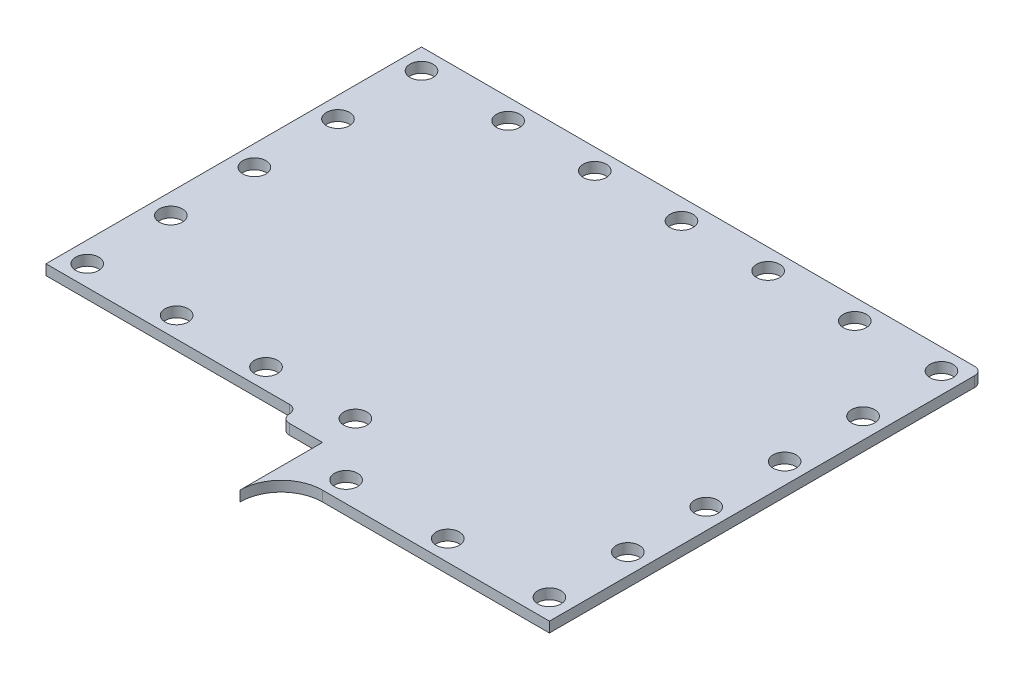
ISO-10303-21;
HEADER;
FILE_DESCRIPTION(('STEP AP214'),'2;1');
FILE_NAME('part.step','',(''),(''),'','','');
FILE_SCHEMA(('AUTOMOTIVE_DESIGN { 1 0 10303 214 1 1 1 1 }'));
ENDSEC;
DATA;
#1=APPLICATION_CONTEXT('core data for automotive mechanical design processes');
#2=APPLICATION_PROTOCOL_DEFINITION('international standard','automotive_design',2000,#1);
#3=PRODUCT_CONTEXT('',#1,'mechanical');
#4=PRODUCT('Part','Part','',(#3));
#5=PRODUCT_RELATED_PRODUCT_CATEGORY('part','',(#4));
#6=PRODUCT_DEFINITION_FORMATION('','',#4);
#7=PRODUCT_DEFINITION_CONTEXT('part definition',#1,'design');
#8=PRODUCT_DEFINITION('design','',#6,#7);
#9=PRODUCT_DEFINITION_SHAPE('','',#8);
#10=(LENGTH_UNIT() NAMED_UNIT(*) SI_UNIT(.MILLI.,.METRE.));
#11=(NAMED_UNIT(*) PLANE_ANGLE_UNIT() SI_UNIT($,.RADIAN.));
#12=(NAMED_UNIT(*) SI_UNIT($,.STERADIAN.) SOLID_ANGLE_UNIT());
#13=UNCERTAINTY_MEASURE_WITH_UNIT(LENGTH_MEASURE(1.E-05),#10,'distance_accuracy_value','');
#14=(GEOMETRIC_REPRESENTATION_CONTEXT(3) GLOBAL_UNCERTAINTY_ASSIGNED_CONTEXT((#13)) GLOBAL_UNIT_ASSIGNED_CONTEXT((#10,
#11,#12)) REPRESENTATION_CONTEXT('',''));
#15=CARTESIAN_POINT('',(0.,0.,0.));
#16=DIRECTION('',(0.,0.,1.));
#17=DIRECTION('',(1.,0.,0.));
#18=AXIS2_PLACEMENT_3D('',#15,#16,#17);
#19=CARTESIAN_POINT('',(8.88999999999993,1.5875,73.025));
#20=DIRECTION('',(0.,-1.,0.));
#21=DIRECTION('',(0.,0.,-1.));
#22=AXIS2_PLACEMENT_3D('',#19,#20,#21);
#23=CYLINDRICAL_SURFACE('',#22,6.34999999999999);
#24=CARTESIAN_POINT('',(8.88999999999993,0.,73.025));
#25=DIRECTION('',(0.,-1.,0.));
#26=DIRECTION('',(0.,0.,1.));
#27=AXIS2_PLACEMENT_3D('',#24,#25,#26);
#28=CIRCLE('',#27,6.34999999999999);
#29=CARTESIAN_POINT('',(2.53999999999993,0.,73.025));
#30=VERTEX_POINT('',#29);
#31=CARTESIAN_POINT('',(8.8899999999999,0.,66.675));
#32=VERTEX_POINT('',#31);
#33=EDGE_CURVE('E154',#30,#32,#28,.T.);
#34=ORIENTED_EDGE('',*,*,#33,.T.);
#35=DIRECTION('',(0.,-1.,0.));
#36=VECTOR('',#35,1.);
#37=CARTESIAN_POINT('',(8.8899999999999,1.5875,66.675));
#38=LINE('',#37,#36);
#39=CARTESIAN_POINT('',(8.8899999999999,1.5875,66.675));
#40=VERTEX_POINT('',#39);
#41=EDGE_CURVE('E11',#40,#32,#38,.T.);
#42=ORIENTED_EDGE('',*,*,#41,.F.);
#43=CARTESIAN_POINT('',(8.88999999999993,1.5875,73.025));
#44=DIRECTION('',(0.,-1.,0.));
#45=DIRECTION('',(0.,0.,1.));
#46=AXIS2_PLACEMENT_3D('',#43,#44,#45);
#47=CIRCLE('',#46,6.34999999999999);
#48=CARTESIAN_POINT('',(2.53999999999993,1.5875,73.025));
#49=VERTEX_POINT('',#48);
#50=EDGE_CURVE('E175',#49,#40,#47,.T.);
#51=ORIENTED_EDGE('',*,*,#50,.F.);
#52=DIRECTION('',(0.,-1.,0.));
#53=VECTOR('',#52,1.);
#54=CARTESIAN_POINT('',(2.53999999999993,1.5875,73.025));
#55=LINE('',#54,#53);
#56=EDGE_CURVE('E150',#49,#30,#55,.T.);
#57=ORIENTED_EDGE('',*,*,#56,.T.);
#58=EDGE_LOOP('',(#34,#42,#51,#57));
#59=FACE_BOUND('',#58,.T.);
#60=ADVANCED_FACE('F40',(#59),#23,.F.);
#61=CARTESIAN_POINT('',(8.8899999999999,1.5875,66.675));
#62=DIRECTION('',(0.,0.,-1.));
#63=DIRECTION('',(-1.,0.,0.));
#64=AXIS2_PLACEMENT_3D('',#61,#62,#63);
#65=PLANE('',#64);
#66=DIRECTION('',(1.,0.,0.));
#67=VECTOR('',#66,1.);
#68=CARTESIAN_POINT('',(8.8899999999999,0.,66.675));
#69=LINE('',#68,#67);
#70=CARTESIAN_POINT('',(43.815,0.,66.675));
#71=VERTEX_POINT('',#70);
#72=EDGE_CURVE('E157',#32,#71,#69,.T.);
#73=ORIENTED_EDGE('',*,*,#72,.T.);
#74=DIRECTION('',(0.,-1.,0.));
#75=VECTOR('',#74,1.);
#76=CARTESIAN_POINT('',(43.815,1.5875,66.675));
#77=LINE('',#76,#75);
#78=CARTESIAN_POINT('',(43.815,1.5875,66.675));
#79=VERTEX_POINT('',#78);
#80=EDGE_CURVE('E48',#79,#71,#77,.T.);
#81=ORIENTED_EDGE('',*,*,#80,.F.);
#82=DIRECTION('',(1.,0.,0.));
#83=VECTOR('',#82,1.);
#84=CARTESIAN_POINT('',(8.8899999999999,1.5875,66.675));
#85=LINE('',#84,#83);
#86=EDGE_CURVE('E108',#40,#79,#85,.T.);
#87=ORIENTED_EDGE('',*,*,#86,.F.);
#88=ORIENTED_EDGE('',*,*,#41,.T.);
#89=EDGE_LOOP('',(#73,#81,#87,#88));
#90=FACE_BOUND('',#89,.T.);
#91=ADVANCED_FACE('F248',(#90),#65,.F.);
#92=CARTESIAN_POINT('',(43.815,1.5875,66.675));
#93=DIRECTION('',(-1.,0.,0.));
#94=DIRECTION('',(0.,0.,1.));
#95=AXIS2_PLACEMENT_3D('',#92,#93,#94);
#96=PLANE('',#95);
#97=DIRECTION('',(0.,0.,-1.));
#98=VECTOR('',#97,1.);
#99=CARTESIAN_POINT('',(43.815,0.,66.675));
#100=LINE('',#99,#98);
#101=CARTESIAN_POINT('',(43.815,0.,1.26999999999999));
#102=VERTEX_POINT('',#101);
#103=EDGE_CURVE('E160',#71,#102,#100,.T.);
#104=ORIENTED_EDGE('',*,*,#103,.T.);
#105=DIRECTION('',(0.,-1.,0.));
#106=VECTOR('',#105,1.);
#107=CARTESIAN_POINT('',(43.815,1.5875,1.26999999999999));
#108=LINE('',#107,#106);
#109=CARTESIAN_POINT('',(43.815,1.5875,1.26999999999999));
#110=VERTEX_POINT('',#109);
#111=EDGE_CURVE('E191',#110,#102,#108,.T.);
#112=ORIENTED_EDGE('',*,*,#111,.F.);
#113=DIRECTION('',(0.,0.,-1.));
#114=VECTOR('',#113,1.);
#115=CARTESIAN_POINT('',(43.815,1.5875,66.675));
#116=LINE('',#115,#114);
#117=EDGE_CURVE('E199',#79,#110,#116,.T.);
#118=ORIENTED_EDGE('',*,*,#117,.F.);
#119=ORIENTED_EDGE('',*,*,#80,.T.);
#120=EDGE_LOOP('',(#104,#112,#118,#119));
#121=FACE_BOUND('',#120,.T.);
#122=ADVANCED_FACE('F197',(#121),#96,.F.);
#123=CARTESIAN_POINT('',(42.5796667647193,1.5875,1.23533323528069));
#124=DIRECTION('',(0.,-1.,0.));
#125=DIRECTION('',(0.,0.,-1.));
#126=AXIS2_PLACEMENT_3D('',#123,#124,#125);
#127=CYLINDRICAL_SURFACE('',#126,1.23581956076328);
#128=CARTESIAN_POINT('',(42.5796667647193,0.,1.23533323528069));
#129=DIRECTION('',(0.,1.,0.));
#130=DIRECTION('',(0.,0.,1.));
#131=AXIS2_PLACEMENT_3D('',#128,#129,#130);
#132=CIRCLE('',#131,1.23581956076328);
#133=CARTESIAN_POINT('',(42.545,0.,0.));
#134=VERTEX_POINT('',#133);
#135=EDGE_CURVE('E162',#102,#134,#132,.T.);
#136=ORIENTED_EDGE('',*,*,#135,.T.);
#137=DIRECTION('',(0.,-1.,0.));
#138=VECTOR('',#137,1.);
#139=CARTESIAN_POINT('',(42.545,1.5875,0.));
#140=LINE('',#139,#138);
#141=CARTESIAN_POINT('',(42.545,1.5875,0.));
#142=VERTEX_POINT('',#141);
#143=EDGE_CURVE('E188',#142,#134,#140,.T.);
#144=ORIENTED_EDGE('',*,*,#143,.F.);
#145=CARTESIAN_POINT('',(42.5796667647193,1.5875,1.23533323528069));
#146=DIRECTION('',(0.,1.,0.));
#147=DIRECTION('',(0.,0.,1.));
#148=AXIS2_PLACEMENT_3D('',#145,#146,#147);
#149=CIRCLE('',#148,1.23581956076328);
#150=EDGE_CURVE('E217',#110,#142,#149,.T.);
#151=ORIENTED_EDGE('',*,*,#150,.F.);
#152=ORIENTED_EDGE('',*,*,#111,.T.);
#153=EDGE_LOOP('',(#136,#144,#151,#152));
#154=FACE_BOUND('',#153,.T.);
#155=ADVANCED_FACE('F208',(#154),#127,.T.);
#156=CARTESIAN_POINT('',(42.545,1.5875,0.));
#157=DIRECTION('',(0.,0.,1.));
#158=DIRECTION('',(1.,0.,0.));
#159=AXIS2_PLACEMENT_3D('',#156,#157,#158);
#160=PLANE('',#159);
#161=DIRECTION('',(-1.,0.,0.));
#162=VECTOR('',#161,1.);
#163=CARTESIAN_POINT('',(42.545,0.,0.));
#164=LINE('',#163,#162);
#165=CARTESIAN_POINT('',(-42.545,0.,0.));
#166=VERTEX_POINT('',#165);
#167=EDGE_CURVE('E164',#134,#166,#164,.T.);
#168=ORIENTED_EDGE('',*,*,#167,.T.);
#169=DIRECTION('',(0.,-1.,0.));
#170=VECTOR('',#169,1.);
#171=CARTESIAN_POINT('',(-42.545,1.5875,0.));
#172=LINE('',#171,#170);
#173=CARTESIAN_POINT('',(-42.545,1.5875,0.));
#174=VERTEX_POINT('',#173);
#175=EDGE_CURVE('E185',#174,#166,#172,.T.);
#176=ORIENTED_EDGE('',*,*,#175,.F.);
#177=DIRECTION('',(-1.,0.,0.));
#178=VECTOR('',#177,1.);
#179=CARTESIAN_POINT('',(42.545,1.5875,0.));
#180=LINE('',#179,#178);
#181=EDGE_CURVE('E214',#142,#174,#180,.T.);
#182=ORIENTED_EDGE('',*,*,#181,.F.);
#183=ORIENTED_EDGE('',*,*,#143,.T.);
#184=EDGE_LOOP('',(#168,#176,#182,#183));
#185=FACE_BOUND('',#184,.T.);
#186=ADVANCED_FACE('F212',(#185),#160,.F.);
#187=CARTESIAN_POINT('',(-42.545,1.5875,0.));
#188=DIRECTION('',(1.,0.,0.));
#189=DIRECTION('',(0.,0.,-1.));
#190=AXIS2_PLACEMENT_3D('',#187,#188,#189);
#191=PLANE('',#190);
#192=DIRECTION('',(0.,0.,1.));
#193=VECTOR('',#192,1.);
#194=CARTESIAN_POINT('',(-42.545,0.,0.));
#195=LINE('',#194,#193);
#196=CARTESIAN_POINT('',(-42.5450000000002,0.,57.785));
#197=VERTEX_POINT('',#196);
#198=EDGE_CURVE('E166',#166,#197,#195,.T.);
#199=ORIENTED_EDGE('',*,*,#198,.T.);
#200=DIRECTION('',(0.,-1.,0.));
#201=VECTOR('',#200,1.);
#202=CARTESIAN_POINT('',(-42.5450000000002,1.5875,57.785));
#203=LINE('',#202,#201);
#204=CARTESIAN_POINT('',(-42.5450000000002,1.5875,57.785));
#205=VERTEX_POINT('',#204);
#206=EDGE_CURVE('E182',#205,#197,#203,.T.);
#207=ORIENTED_EDGE('',*,*,#206,.F.);
#208=DIRECTION('',(0.,0.,1.));
#209=VECTOR('',#208,1.);
#210=CARTESIAN_POINT('',(-42.545,1.5875,0.));
#211=LINE('',#210,#209);
#212=EDGE_CURVE('E216',#174,#205,#211,.T.);
#213=ORIENTED_EDGE('',*,*,#212,.F.);
#214=ORIENTED_EDGE('',*,*,#175,.T.);
#215=EDGE_LOOP('',(#199,#207,#213,#214));
#216=FACE_BOUND('',#215,.T.);
#217=ADVANCED_FACE('F261',(#216),#191,.F.);
#218=CARTESIAN_POINT('',(-42.5450000000002,1.5875,57.785));
#219=DIRECTION('',(0.,0.,-1.));
#220=DIRECTION('',(-1.,0.,0.));
#221=AXIS2_PLACEMENT_3D('',#218,#219,#220);
#222=PLANE('',#221);
#223=DIRECTION('',(1.,0.,0.));
#224=VECTOR('',#223,1.);
#225=CARTESIAN_POINT('',(-42.5450000000002,0.,57.785));
#226=LINE('',#225,#224);
#227=CARTESIAN_POINT('',(-5.08000000000022,0.,57.785));
#228=VERTEX_POINT('',#227);
#229=EDGE_CURVE('E168',#197,#228,#226,.T.);
#230=ORIENTED_EDGE('',*,*,#229,.T.);
#231=DIRECTION('',(0.,-1.,0.));
#232=VECTOR('',#231,1.);
#233=CARTESIAN_POINT('',(-5.08000000000022,1.5875,57.785));
#234=LINE('',#233,#232);
#235=CARTESIAN_POINT('',(-5.08000000000022,1.5875,57.785));
#236=VERTEX_POINT('',#235);
#237=EDGE_CURVE('E179',#236,#228,#234,.T.);
#238=ORIENTED_EDGE('',*,*,#237,.F.);
#239=DIRECTION('',(1.,0.,0.));
#240=VECTOR('',#239,1.);
#241=CARTESIAN_POINT('',(-42.5450000000002,1.5875,57.785));
#242=LINE('',#241,#240);
#243=EDGE_CURVE('E219',#205,#236,#242,.T.);
#244=ORIENTED_EDGE('',*,*,#243,.F.);
#245=ORIENTED_EDGE('',*,*,#206,.T.);
#246=EDGE_LOOP('',(#230,#238,#244,#245));
#247=FACE_BOUND('',#246,.T.);
#248=ADVANCED_FACE('F228',(#247),#222,.F.);
#249=CARTESIAN_POINT('',(-5.08000000000022,1.5875,59.055));
#250=DIRECTION('',(0.,-1.,0.));
#251=DIRECTION('',(0.,0.,-1.));
#252=AXIS2_PLACEMENT_3D('',#249,#250,#251);
#253=CYLINDRICAL_SURFACE('',#252,1.26999999999999);
#254=CARTESIAN_POINT('',(-5.08000000000022,0.,59.055));
#255=DIRECTION('',(0.,-1.,0.));
#256=DIRECTION('',(0.,0.,-1.));
#257=AXIS2_PLACEMENT_3D('',#254,#255,#256);
#258=CIRCLE('',#257,1.26999999999999);
#259=CARTESIAN_POINT('',(-3.81000000000023,0.,59.0550000000001));
#260=VERTEX_POINT('',#259);
#261=EDGE_CURVE('E170',#228,#260,#258,.T.);
#262=ORIENTED_EDGE('',*,*,#261,.T.);
#263=DIRECTION('',(0.,-1.,0.));
#264=VECTOR('',#263,1.);
#265=CARTESIAN_POINT('',(-3.81000000000023,1.5875,59.0550000000001));
#266=LINE('',#265,#264);
#267=CARTESIAN_POINT('',(-3.81000000000023,1.5875,59.0550000000001));
#268=VERTEX_POINT('',#267);
#269=EDGE_CURVE('E145',#268,#260,#266,.T.);
#270=ORIENTED_EDGE('',*,*,#269,.F.);
#271=CARTESIAN_POINT('',(-5.08000000000022,1.5875,59.055));
#272=DIRECTION('',(0.,-1.,0.));
#273=DIRECTION('',(0.,0.,-1.));
#274=AXIS2_PLACEMENT_3D('',#271,#272,#273);
#275=CIRCLE('',#274,1.26999999999999);
#276=EDGE_CURVE('E136',#236,#268,#275,.T.);
#277=ORIENTED_EDGE('',*,*,#276,.F.);
#278=ORIENTED_EDGE('',*,*,#237,.T.);
#279=EDGE_LOOP('',(#262,#270,#277,#278));
#280=FACE_BOUND('',#279,.T.);
#281=ADVANCED_FACE('F232',(#280),#253,.F.);
#282=CARTESIAN_POINT('',(-2.54000000000024,1.5875,59.0550000000001));
#283=DIRECTION('',(0.,-1.,0.));
#284=DIRECTION('',(0.,0.,-1.));
#285=AXIS2_PLACEMENT_3D('',#282,#283,#284);
#286=CYLINDRICAL_SURFACE('',#285,1.27);
#287=CARTESIAN_POINT('',(-2.54000000000024,0.,59.0550000000001));
#288=DIRECTION('',(0.,1.,0.));
#289=DIRECTION('',(0.,0.,1.));
#290=AXIS2_PLACEMENT_3D('',#287,#288,#289);
#291=CIRCLE('',#290,1.27);
#292=CARTESIAN_POINT('',(-2.54000000000024,0.,60.3250000000001));
#293=VERTEX_POINT('',#292);
#294=EDGE_CURVE('E144',#260,#293,#291,.T.);
#295=ORIENTED_EDGE('',*,*,#294,.T.);
#296=DIRECTION('',(0.,-1.,0.));
#297=VECTOR('',#296,1.);
#298=CARTESIAN_POINT('',(-2.54000000000024,1.5875,60.3250000000001));
#299=LINE('',#298,#297);
#300=CARTESIAN_POINT('',(-2.54000000000024,1.5875,60.3250000000001));
#301=VERTEX_POINT('',#300);
#302=EDGE_CURVE('E141',#301,#293,#299,.T.);
#303=ORIENTED_EDGE('',*,*,#302,.F.);
#304=CARTESIAN_POINT('',(-2.54000000000024,1.5875,59.0550000000001));
#305=DIRECTION('',(0.,1.,0.));
#306=DIRECTION('',(0.,0.,1.));
#307=AXIS2_PLACEMENT_3D('',#304,#305,#306);
#308=CIRCLE('',#307,1.27);
#309=EDGE_CURVE('E130',#268,#301,#308,.T.);
#310=ORIENTED_EDGE('',*,*,#309,.F.);
#311=ORIENTED_EDGE('',*,*,#269,.T.);
#312=EDGE_LOOP('',(#295,#303,#310,#311));
#313=FACE_BOUND('',#312,.T.);
#314=ADVANCED_FACE('F142',(#313),#286,.T.);
#315=CARTESIAN_POINT('',(-2.54000000000022,1.5875,60.3250000000001));
#316=DIRECTION('',(0.,0.,-1.));
#317=DIRECTION('',(-1.,0.,0.));
#318=AXIS2_PLACEMENT_3D('',#315,#316,#317);
#319=PLANE('',#318);
#320=DIRECTION('',(1.,0.,0.));
#321=VECTOR('',#320,1.);
#322=CARTESIAN_POINT('',(-2.54000000000022,0.,60.3250000000001));
#323=LINE('',#322,#321);
#324=CARTESIAN_POINT('',(2.53999999999993,0.,60.325));
#325=VERTEX_POINT('',#324);
#326=EDGE_CURVE('E94',#293,#325,#323,.T.);
#327=ORIENTED_EDGE('',*,*,#326,.T.);
#328=DIRECTION('',(0.,-1.,0.));
#329=VECTOR('',#328,1.);
#330=CARTESIAN_POINT('',(2.53999999999993,1.5875,60.325));
#331=LINE('',#330,#329);
#332=CARTESIAN_POINT('',(2.53999999999993,1.5875,60.325));
#333=VERTEX_POINT('',#332);
#334=EDGE_CURVE('E146',#333,#325,#331,.T.);
#335=ORIENTED_EDGE('',*,*,#334,.F.);
#336=DIRECTION('',(1.,0.,0.));
#337=VECTOR('',#336,1.);
#338=CARTESIAN_POINT('',(-2.54000000000022,1.5875,60.3250000000001));
#339=LINE('',#338,#337);
#340=EDGE_CURVE('E134',#301,#333,#339,.T.);
#341=ORIENTED_EDGE('',*,*,#340,.F.);
#342=ORIENTED_EDGE('',*,*,#302,.T.);
#343=EDGE_LOOP('',(#327,#335,#341,#342));
#344=FACE_BOUND('',#343,.T.);
#345=ADVANCED_FACE('F148',(#344),#319,.F.);
#346=CARTESIAN_POINT('',(2.53999999999993,1.5875,60.325));
#347=DIRECTION('',(1.,0.,0.));
#348=DIRECTION('',(0.,0.,-1.));
#349=AXIS2_PLACEMENT_3D('',#346,#347,#348);
#350=PLANE('',#349);
#351=DIRECTION('',(0.,0.,1.));
#352=VECTOR('',#351,1.);
#353=CARTESIAN_POINT('',(2.53999999999993,0.,60.325));
#354=LINE('',#353,#352);
#355=EDGE_CURVE('E100',#325,#30,#354,.T.);
#356=ORIENTED_EDGE('',*,*,#355,.T.);
#357=ORIENTED_EDGE('',*,*,#56,.F.);
#358=DIRECTION('',(0.,0.,1.));
#359=VECTOR('',#358,1.);
#360=CARTESIAN_POINT('',(2.53999999999993,1.5875,60.325));
#361=LINE('',#360,#359);
#362=EDGE_CURVE('E56',#333,#49,#361,.T.);
#363=ORIENTED_EDGE('',*,*,#362,.F.);
#364=ORIENTED_EDGE('',*,*,#334,.T.);
#365=EDGE_LOOP('',(#356,#357,#363,#364));
#366=FACE_BOUND('',#365,.T.);
#367=ADVANCED_FACE('F236',(#366),#350,.F.);
#368=CARTESIAN_POINT('',(8.88999999999993,1.5875,73.025));
#369=DIRECTION('',(0.,1.,0.));
#370=DIRECTION('',(0.,0.,1.));
#371=AXIS2_PLACEMENT_3D('',#368,#369,#370);
#372=PLANE('',#371);
#373=CARTESIAN_POINT('',(9.34880947261776,1.5875,63.5));
#374=DIRECTION('',(0.,1.,0.));
#375=DIRECTION('',(0.,0.,1.));
#376=AXIS2_PLACEMENT_3D('',#373,#374,#375);
#377=CIRCLE('',#376,1.778);
#378=CARTESIAN_POINT('',(9.34880947261776,1.5875,65.278));
#379=VERTEX_POINT('',#378);
#380=EDGE_CURVE('E158',#379,#379,#377,.T.);
#381=ORIENTED_EDGE('',*,*,#380,.F.);
#382=EDGE_LOOP('',(#381));
#383=FACE_BOUND('',#382,.T.);
#384=CARTESIAN_POINT('',(24.9944047363089,1.5875,63.4999999999999));
#385=DIRECTION('',(0.,1.,0.));
#386=DIRECTION('',(0.,0.,1.));
#387=AXIS2_PLACEMENT_3D('',#384,#385,#386);
#388=CIRCLE('',#387,1.778);
#389=CARTESIAN_POINT('',(24.9944047363089,1.5875,65.2779999999999));
#390=VERTEX_POINT('',#389);
#391=EDGE_CURVE('E612',#390,#390,#388,.T.);
#392=ORIENTED_EDGE('',*,*,#391,.F.);
#393=EDGE_LOOP('',(#392));
#394=FACE_BOUND('',#393,.T.);
#395=CARTESIAN_POINT('',(40.64,1.5875,63.4999999999999));
#396=DIRECTION('',(0.,1.,0.));
#397=DIRECTION('',(0.,0.,1.));
#398=AXIS2_PLACEMENT_3D('',#395,#396,#397);
#399=CIRCLE('',#398,1.778);
#400=CARTESIAN_POINT('',(40.64,1.5875,65.2779999999999));
#401=VERTEX_POINT('',#400);
#402=EDGE_CURVE('E609',#401,#401,#399,.T.);
#403=ORIENTED_EDGE('',*,*,#402,.F.);
#404=EDGE_LOOP('',(#403));
#405=FACE_BOUND('',#404,.T.);
#406=CARTESIAN_POINT('',(40.6399999999999,1.5875,51.4349999999999));
#407=DIRECTION('',(0.,1.,0.));
#408=DIRECTION('',(0.,0.,1.));
#409=AXIS2_PLACEMENT_3D('',#406,#407,#408);
#410=CIRCLE('',#409,1.778);
#411=CARTESIAN_POINT('',(40.6399999999999,1.5875,53.2129999999999));
#412=VERTEX_POINT('',#411);
#413=EDGE_CURVE('E606',#412,#412,#410,.T.);
#414=ORIENTED_EDGE('',*,*,#413,.F.);
#415=EDGE_LOOP('',(#414));
#416=FACE_BOUND('',#415,.T.);
#417=CARTESIAN_POINT('',(-39.3699999999999,1.5875,41.75125));
#418=DIRECTION('',(0.,1.,0.));
#419=DIRECTION('',(0.,0.,1.));
#420=AXIS2_PLACEMENT_3D('',#417,#418,#419);
#421=CIRCLE('',#420,1.778);
#422=CARTESIAN_POINT('',(-39.3699999999999,1.5875,43.52925));
#423=VERTEX_POINT('',#422);
#424=EDGE_CURVE('E603',#423,#423,#421,.T.);
#425=ORIENTED_EDGE('',*,*,#424,.F.);
#426=EDGE_LOOP('',(#425));
#427=FACE_BOUND('',#426,.T.);
#428=CARTESIAN_POINT('',(40.6399999999998,1.5875,15.24));
#429=DIRECTION('',(0.,1.,0.));
#430=DIRECTION('',(0.,0.,1.));
#431=AXIS2_PLACEMENT_3D('',#428,#429,#430);
#432=CIRCLE('',#431,1.778);
#433=CARTESIAN_POINT('',(40.6399999999998,1.5875,17.018));
#434=VERTEX_POINT('',#433);
#435=EDGE_CURVE('E600',#434,#434,#432,.T.);
#436=ORIENTED_EDGE('',*,*,#435,.F.);
#437=EDGE_LOOP('',(#436));
#438=FACE_BOUND('',#437,.T.);
#439=CARTESIAN_POINT('',(40.6399999999999,1.5875,27.305));
#440=DIRECTION('',(0.,1.,0.));
#441=DIRECTION('',(0.,0.,1.));
#442=AXIS2_PLACEMENT_3D('',#439,#440,#441);
#443=CIRCLE('',#442,1.778);
#444=CARTESIAN_POINT('',(40.6399999999999,1.5875,29.083));
#445=VERTEX_POINT('',#444);
#446=EDGE_CURVE('E597',#445,#445,#443,.T.);
#447=ORIENTED_EDGE('',*,*,#446,.F.);
#448=EDGE_LOOP('',(#447));
#449=FACE_BOUND('',#448,.T.);
#450=CARTESIAN_POINT('',(40.6399999999999,1.5875,39.3699999999999));
#451=DIRECTION('',(0.,1.,0.));
#452=DIRECTION('',(0.,0.,1.));
#453=AXIS2_PLACEMENT_3D('',#450,#451,#452);
#454=CIRCLE('',#453,1.778);
#455=CARTESIAN_POINT('',(40.6399999999999,1.5875,41.1479999999999));
#456=VERTEX_POINT('',#455);
#457=EDGE_CURVE('E594',#456,#456,#454,.T.);
#458=ORIENTED_EDGE('',*,*,#457,.F.);
#459=EDGE_LOOP('',(#458));
#460=FACE_BOUND('',#459,.T.);
#461=CARTESIAN_POINT('',(-26.0350000000001,1.5875,3.1749999999999));
#462=DIRECTION('',(0.,1.,0.));
#463=DIRECTION('',(0.,0.,1.));
#464=AXIS2_PLACEMENT_3D('',#461,#462,#463);
#465=CIRCLE('',#464,1.778);
#466=CARTESIAN_POINT('',(-26.0350000000001,1.5875,4.9529999999999));
#467=VERTEX_POINT('',#466);
#468=EDGE_CURVE('E591',#467,#467,#465,.T.);
#469=ORIENTED_EDGE('',*,*,#468,.F.);
#470=EDGE_LOOP('',(#469));
#471=FACE_BOUND('',#470,.T.);
#472=CARTESIAN_POINT('',(-12.7000000000001,1.5875,3.17499999999981));
#473=DIRECTION('',(0.,1.,0.));
#474=DIRECTION('',(0.,0.,1.));
#475=AXIS2_PLACEMENT_3D('',#472,#473,#474);
#476=CIRCLE('',#475,1.778);
#477=CARTESIAN_POINT('',(-12.7000000000001,1.5875,4.95299999999981));
#478=VERTEX_POINT('',#477);
#479=EDGE_CURVE('E588',#478,#478,#476,.T.);
#480=ORIENTED_EDGE('',*,*,#479,.F.);
#481=EDGE_LOOP('',(#480));
#482=FACE_BOUND('',#481,.T.);
#483=CARTESIAN_POINT('',(0.634999999999789,1.5875,3.17499999999972));
#484=DIRECTION('',(0.,1.,0.));
#485=DIRECTION('',(0.,0.,1.));
#486=AXIS2_PLACEMENT_3D('',#483,#484,#485);
#487=CIRCLE('',#486,1.778);
#488=CARTESIAN_POINT('',(0.634999999999789,1.5875,4.95299999999972));
#489=VERTEX_POINT('',#488);
#490=EDGE_CURVE('E585',#489,#489,#487,.T.);
#491=ORIENTED_EDGE('',*,*,#490,.F.);
#492=EDGE_LOOP('',(#491));
#493=FACE_BOUND('',#492,.T.);
#494=CARTESIAN_POINT('',(13.9699999999997,1.5875,3.17499999999962));
#495=DIRECTION('',(0.,1.,0.));
#496=DIRECTION('',(0.,0.,1.));
#497=AXIS2_PLACEMENT_3D('',#494,#495,#496);
#498=CIRCLE('',#497,1.778);
#499=CARTESIAN_POINT('',(13.9699999999997,1.5875,4.95299999999962));
#500=VERTEX_POINT('',#499);
#501=EDGE_CURVE('E582',#500,#500,#498,.T.);
#502=ORIENTED_EDGE('',*,*,#501,.F.);
#503=EDGE_LOOP('',(#502));
#504=FACE_BOUND('',#503,.T.);
#505=CARTESIAN_POINT('',(27.3049999999996,1.5875,3.17499999999953));
#506=DIRECTION('',(0.,1.,0.));
#507=DIRECTION('',(0.,0.,1.));
#508=AXIS2_PLACEMENT_3D('',#505,#506,#507);
#509=CIRCLE('',#508,1.778);
#510=CARTESIAN_POINT('',(27.3049999999996,1.5875,4.95299999999953));
#511=VERTEX_POINT('',#510);
#512=EDGE_CURVE('E579',#511,#511,#509,.T.);
#513=ORIENTED_EDGE('',*,*,#512,.F.);
#514=EDGE_LOOP('',(#513));
#515=FACE_BOUND('',#514,.T.);
#516=CARTESIAN_POINT('',(40.6399999999996,1.5875,3.17499999999963));
#517=DIRECTION('',(0.,1.,0.));
#518=DIRECTION('',(0.,0.,1.));
#519=AXIS2_PLACEMENT_3D('',#516,#517,#518);
#520=CIRCLE('',#519,1.778);
#521=CARTESIAN_POINT('',(40.6399999999996,1.5875,4.95299999999963));
#522=VERTEX_POINT('',#521);
#523=EDGE_CURVE('E576',#522,#522,#520,.T.);
#524=ORIENTED_EDGE('',*,*,#523,.F.);
#525=EDGE_LOOP('',(#524));
#526=FACE_BOUND('',#525,.T.);
#527=CARTESIAN_POINT('',(-39.37,1.5875,16.03375));
#528=DIRECTION('',(0.,1.,0.));
#529=DIRECTION('',(0.,0.,1.));
#530=AXIS2_PLACEMENT_3D('',#527,#528,#529);
#531=CIRCLE('',#530,1.778);
#532=CARTESIAN_POINT('',(-39.37,1.5875,17.81175));
#533=VERTEX_POINT('',#532);
#534=EDGE_CURVE('E573',#533,#533,#531,.T.);
#535=ORIENTED_EDGE('',*,*,#534,.F.);
#536=EDGE_LOOP('',(#535));
#537=FACE_BOUND('',#536,.T.);
#538=CARTESIAN_POINT('',(-39.3699999999999,1.5875,28.8925));
#539=DIRECTION('',(0.,1.,0.));
#540=DIRECTION('',(0.,0.,1.));
#541=AXIS2_PLACEMENT_3D('',#538,#539,#540);
#542=CIRCLE('',#541,1.778);
#543=CARTESIAN_POINT('',(-39.3699999999999,1.5875,30.6705));
#544=VERTEX_POINT('',#543);
#545=EDGE_CURVE('E570',#544,#544,#542,.T.);
#546=ORIENTED_EDGE('',*,*,#545,.F.);
#547=EDGE_LOOP('',(#546));
#548=FACE_BOUND('',#547,.T.);
#549=CARTESIAN_POINT('',(1.88921375145161,1.5875,54.6099999999999));
#550=DIRECTION('',(0.,1.,0.));
#551=DIRECTION('',(0.,0.,1.));
#552=AXIS2_PLACEMENT_3D('',#549,#550,#551);
#553=CIRCLE('',#552,1.778);
#554=CARTESIAN_POINT('',(1.88921375145161,1.5875,56.3879999999999));
#555=VERTEX_POINT('',#554);
#556=EDGE_CURVE('E567',#555,#555,#553,.T.);
#557=ORIENTED_EDGE('',*,*,#556,.F.);
#558=EDGE_LOOP('',(#557));
#559=FACE_BOUND('',#558,.T.);
#560=CARTESIAN_POINT('',(-11.8638574990322,1.5875,54.6099999999999));
#561=DIRECTION('',(0.,1.,0.));
#562=DIRECTION('',(0.,0.,1.));
#563=AXIS2_PLACEMENT_3D('',#560,#561,#562);
#564=CIRCLE('',#563,1.778);
#565=CARTESIAN_POINT('',(-11.8638574990322,1.5875,56.3879999999999));
#566=VERTEX_POINT('',#565);
#567=EDGE_CURVE('E564',#566,#566,#564,.T.);
#568=ORIENTED_EDGE('',*,*,#567,.F.);
#569=EDGE_LOOP('',(#568));
#570=FACE_BOUND('',#569,.T.);
#571=CARTESIAN_POINT('',(-25.616928749516,1.5875,54.6099999999999));
#572=DIRECTION('',(0.,1.,0.));
#573=DIRECTION('',(0.,0.,1.));
#574=AXIS2_PLACEMENT_3D('',#571,#572,#573);
#575=CIRCLE('',#574,1.778);
#576=CARTESIAN_POINT('',(-25.616928749516,1.5875,56.3879999999999));
#577=VERTEX_POINT('',#576);
#578=EDGE_CURVE('E561',#577,#577,#575,.T.);
#579=ORIENTED_EDGE('',*,*,#578,.F.);
#580=EDGE_LOOP('',(#579));
#581=FACE_BOUND('',#580,.T.);
#582=CARTESIAN_POINT('',(-39.3699999999998,1.5875,54.61));
#583=DIRECTION('',(0.,1.,0.));
#584=DIRECTION('',(0.,0.,1.));
#585=AXIS2_PLACEMENT_3D('',#582,#583,#584);
#586=CIRCLE('',#585,1.778);
#587=CARTESIAN_POINT('',(-39.3699999999998,1.5875,56.388));
#588=VERTEX_POINT('',#587);
#589=EDGE_CURVE('E558',#588,#588,#586,.T.);
#590=ORIENTED_EDGE('',*,*,#589,.F.);
#591=EDGE_LOOP('',(#590));
#592=FACE_BOUND('',#591,.T.);
#593=CARTESIAN_POINT('',(-39.37,1.5875,3.175));
#594=DIRECTION('',(0.,1.,0.));
#595=DIRECTION('',(0.,0.,1.));
#596=AXIS2_PLACEMENT_3D('',#593,#594,#595);
#597=CIRCLE('',#596,1.778);
#598=CARTESIAN_POINT('',(-39.37,1.5875,4.953));
#599=VERTEX_POINT('',#598);
#600=EDGE_CURVE('E555',#599,#599,#597,.T.);
#601=ORIENTED_EDGE('',*,*,#600,.F.);
#602=EDGE_LOOP('',(#601));
#603=FACE_BOUND('',#602,.T.);
#604=ORIENTED_EDGE('',*,*,#50,.T.);
#605=ORIENTED_EDGE('',*,*,#86,.T.);
#606=ORIENTED_EDGE('',*,*,#117,.T.);
#607=ORIENTED_EDGE('',*,*,#150,.T.);
#608=ORIENTED_EDGE('',*,*,#181,.T.);
#609=ORIENTED_EDGE('',*,*,#212,.T.);
#610=ORIENTED_EDGE('',*,*,#243,.T.);
#611=ORIENTED_EDGE('',*,*,#276,.T.);
#612=ORIENTED_EDGE('',*,*,#309,.T.);
#613=ORIENTED_EDGE('',*,*,#340,.T.);
#614=ORIENTED_EDGE('',*,*,#362,.T.);
#615=EDGE_LOOP('',(#604,#605,#606,#607,#608,#609,#610,#611,#612,#613,#614));
#616=FACE_BOUND('',#615,.T.);
#617=ADVANCED_FACE('F132',(#383,#394,#405,#416,#427,#438,#449,#460,#471,#482,#493,#504,#515,
#526,#537,#548,#559,#570,#581,#592,#603,#616),#372,.T.);
#618=CARTESIAN_POINT('',(8.88999999999993,0.,73.025));
#619=DIRECTION('',(0.,1.,0.));
#620=DIRECTION('',(0.,0.,1.));
#621=AXIS2_PLACEMENT_3D('',#618,#619,#620);
#622=PLANE('',#621);
#623=CARTESIAN_POINT('',(9.34880947261776,0.,63.5));
#624=DIRECTION('',(0.,1.,0.));
#625=DIRECTION('',(0.,0.,1.));
#626=AXIS2_PLACEMENT_3D('',#623,#624,#625);
#627=CIRCLE('',#626,1.778);
#628=CARTESIAN_POINT('',(9.34880947261776,0.,65.278));
#629=VERTEX_POINT('',#628);
#630=EDGE_CURVE('E515',#629,#629,#627,.T.);
#631=ORIENTED_EDGE('',*,*,#630,.T.);
#632=EDGE_LOOP('',(#631));
#633=FACE_BOUND('',#632,.T.);
#634=CARTESIAN_POINT('',(24.9944047363089,0.,63.4999999999999));
#635=DIRECTION('',(0.,1.,0.));
#636=DIRECTION('',(0.,0.,1.));
#637=AXIS2_PLACEMENT_3D('',#634,#635,#636);
#638=CIRCLE('',#637,1.778);
#639=CARTESIAN_POINT('',(24.9944047363089,0.,65.2779999999999));
#640=VERTEX_POINT('',#639);
#641=EDGE_CURVE('E516',#640,#640,#638,.T.);
#642=ORIENTED_EDGE('',*,*,#641,.T.);
#643=EDGE_LOOP('',(#642));
#644=FACE_BOUND('',#643,.T.);
#645=CARTESIAN_POINT('',(40.64,0.,63.4999999999999));
#646=DIRECTION('',(0.,1.,0.));
#647=DIRECTION('',(0.,0.,1.));
#648=AXIS2_PLACEMENT_3D('',#645,#646,#647);
#649=CIRCLE('',#648,1.778);
#650=CARTESIAN_POINT('',(40.64,0.,65.2779999999999));
#651=VERTEX_POINT('',#650);
#652=EDGE_CURVE('E520',#651,#651,#649,.T.);
#653=ORIENTED_EDGE('',*,*,#652,.T.);
#654=EDGE_LOOP('',(#653));
#655=FACE_BOUND('',#654,.T.);
#656=CARTESIAN_POINT('',(40.6399999999999,0.,51.4349999999999));
#657=DIRECTION('',(0.,1.,0.));
#658=DIRECTION('',(0.,0.,1.));
#659=AXIS2_PLACEMENT_3D('',#656,#657,#658);
#660=CIRCLE('',#659,1.778);
#661=CARTESIAN_POINT('',(40.6399999999999,0.,53.2129999999999));
#662=VERTEX_POINT('',#661);
#663=EDGE_CURVE('E679',#662,#662,#660,.T.);
#664=ORIENTED_EDGE('',*,*,#663,.T.);
#665=EDGE_LOOP('',(#664));
#666=FACE_BOUND('',#665,.T.);
#667=CARTESIAN_POINT('',(-39.3699999999999,0.,41.75125));
#668=DIRECTION('',(0.,1.,0.));
#669=DIRECTION('',(0.,0.,1.));
#670=AXIS2_PLACEMENT_3D('',#667,#668,#669);
#671=CIRCLE('',#670,1.778);
#672=CARTESIAN_POINT('',(-39.3699999999999,0.,43.52925));
#673=VERTEX_POINT('',#672);
#674=EDGE_CURVE('E540',#673,#673,#671,.T.);
#675=ORIENTED_EDGE('',*,*,#674,.T.);
#676=EDGE_LOOP('',(#675));
#677=FACE_BOUND('',#676,.T.);
#678=CARTESIAN_POINT('',(40.6399999999998,0.,15.24));
#679=DIRECTION('',(0.,1.,0.));
#680=DIRECTION('',(0.,0.,1.));
#681=AXIS2_PLACEMENT_3D('',#678,#679,#680);
#682=CIRCLE('',#681,1.778);
#683=CARTESIAN_POINT('',(40.6399999999998,0.,17.018));
#684=VERTEX_POINT('',#683);
#685=EDGE_CURVE('E675',#684,#684,#682,.T.);
#686=ORIENTED_EDGE('',*,*,#685,.T.);
#687=EDGE_LOOP('',(#686));
#688=FACE_BOUND('',#687,.T.);
#689=CARTESIAN_POINT('',(40.6399999999999,0.,27.305));
#690=DIRECTION('',(0.,1.,0.));
#691=DIRECTION('',(0.,0.,1.));
#692=AXIS2_PLACEMENT_3D('',#689,#690,#691);
#693=CIRCLE('',#692,1.778);
#694=CARTESIAN_POINT('',(40.6399999999999,0.,29.083));
#695=VERTEX_POINT('',#694);
#696=EDGE_CURVE('E672',#695,#695,#693,.T.);
#697=ORIENTED_EDGE('',*,*,#696,.T.);
#698=EDGE_LOOP('',(#697));
#699=FACE_BOUND('',#698,.T.);
#700=CARTESIAN_POINT('',(40.6399999999999,0.,39.3699999999999));
#701=DIRECTION('',(0.,1.,0.));
#702=DIRECTION('',(0.,0.,1.));
#703=AXIS2_PLACEMENT_3D('',#700,#701,#702);
#704=CIRCLE('',#703,1.778);
#705=CARTESIAN_POINT('',(40.6399999999999,0.,41.1479999999999));
#706=VERTEX_POINT('',#705);
#707=EDGE_CURVE('E676',#706,#706,#704,.T.);
#708=ORIENTED_EDGE('',*,*,#707,.T.);
#709=EDGE_LOOP('',(#708));
#710=FACE_BOUND('',#709,.T.);
#711=CARTESIAN_POINT('',(-26.0350000000001,0.,3.1749999999999));
#712=DIRECTION('',(0.,1.,0.));
#713=DIRECTION('',(0.,0.,1.));
#714=AXIS2_PLACEMENT_3D('',#711,#712,#713);
#715=CIRCLE('',#714,1.778);
#716=CARTESIAN_POINT('',(-26.0350000000001,0.,4.9529999999999));
#717=VERTEX_POINT('',#716);
#718=EDGE_CURVE('E541',#717,#717,#715,.T.);
#719=ORIENTED_EDGE('',*,*,#718,.T.);
#720=EDGE_LOOP('',(#719));
#721=FACE_BOUND('',#720,.T.);
#722=CARTESIAN_POINT('',(-12.7000000000001,0.,3.17499999999981));
#723=DIRECTION('',(0.,1.,0.));
#724=DIRECTION('',(0.,0.,1.));
#725=AXIS2_PLACEMENT_3D('',#722,#723,#724);
#726=CIRCLE('',#725,1.778);
#727=CARTESIAN_POINT('',(-12.7000000000001,0.,4.95299999999981));
#728=VERTEX_POINT('',#727);
#729=EDGE_CURVE('E545',#728,#728,#726,.T.);
#730=ORIENTED_EDGE('',*,*,#729,.T.);
#731=EDGE_LOOP('',(#730));
#732=FACE_BOUND('',#731,.T.);
#733=CARTESIAN_POINT('',(0.634999999999789,0.,3.17499999999972));
#734=DIRECTION('',(0.,1.,0.));
#735=DIRECTION('',(0.,0.,1.));
#736=AXIS2_PLACEMENT_3D('',#733,#734,#735);
#737=CIRCLE('',#736,1.778);
#738=CARTESIAN_POINT('',(0.634999999999789,0.,4.95299999999972));
#739=VERTEX_POINT('',#738);
#740=EDGE_CURVE('E548',#739,#739,#737,.T.);
#741=ORIENTED_EDGE('',*,*,#740,.T.);
#742=EDGE_LOOP('',(#741));
#743=FACE_BOUND('',#742,.T.);
#744=CARTESIAN_POINT('',(13.9699999999997,0.,3.17499999999962));
#745=DIRECTION('',(0.,1.,0.));
#746=DIRECTION('',(0.,0.,1.));
#747=AXIS2_PLACEMENT_3D('',#744,#745,#746);
#748=CIRCLE('',#747,1.778);
#749=CARTESIAN_POINT('',(13.9699999999997,0.,4.95299999999962));
#750=VERTEX_POINT('',#749);
#751=EDGE_CURVE('E530',#750,#750,#748,.T.);
#752=ORIENTED_EDGE('',*,*,#751,.T.);
#753=EDGE_LOOP('',(#752));
#754=FACE_BOUND('',#753,.T.);
#755=CARTESIAN_POINT('',(27.3049999999996,0.,3.17499999999953));
#756=DIRECTION('',(0.,1.,0.));
#757=DIRECTION('',(0.,0.,1.));
#758=AXIS2_PLACEMENT_3D('',#755,#756,#757);
#759=CIRCLE('',#758,1.778);
#760=CARTESIAN_POINT('',(27.3049999999996,0.,4.95299999999953));
#761=VERTEX_POINT('',#760);
#762=EDGE_CURVE('E527',#761,#761,#759,.T.);
#763=ORIENTED_EDGE('',*,*,#762,.T.);
#764=EDGE_LOOP('',(#763));
#765=FACE_BOUND('',#764,.T.);
#766=CARTESIAN_POINT('',(40.6399999999996,0.,3.17499999999963));
#767=DIRECTION('',(0.,1.,0.));
#768=DIRECTION('',(0.,0.,1.));
#769=AXIS2_PLACEMENT_3D('',#766,#767,#768);
#770=CIRCLE('',#769,1.778);
#771=CARTESIAN_POINT('',(40.6399999999996,0.,4.95299999999963));
#772=VERTEX_POINT('',#771);
#773=EDGE_CURVE('E531',#772,#772,#770,.T.);
#774=ORIENTED_EDGE('',*,*,#773,.T.);
#775=EDGE_LOOP('',(#774));
#776=FACE_BOUND('',#775,.T.);
#777=CARTESIAN_POINT('',(-39.37,0.,16.03375));
#778=DIRECTION('',(0.,1.,0.));
#779=DIRECTION('',(0.,0.,1.));
#780=AXIS2_PLACEMENT_3D('',#777,#778,#779);
#781=CIRCLE('',#780,1.778);
#782=CARTESIAN_POINT('',(-39.37,0.,17.81175));
#783=VERTEX_POINT('',#782);
#784=EDGE_CURVE('E534',#783,#783,#781,.T.);
#785=ORIENTED_EDGE('',*,*,#784,.T.);
#786=EDGE_LOOP('',(#785));
#787=FACE_BOUND('',#786,.T.);
#788=CARTESIAN_POINT('',(-39.3699999999999,0.,28.8925));
#789=DIRECTION('',(0.,1.,0.));
#790=DIRECTION('',(0.,0.,1.));
#791=AXIS2_PLACEMENT_3D('',#788,#789,#790);
#792=CIRCLE('',#791,1.778);
#793=CARTESIAN_POINT('',(-39.3699999999999,0.,30.6705));
#794=VERTEX_POINT('',#793);
#795=EDGE_CURVE('E537',#794,#794,#792,.T.);
#796=ORIENTED_EDGE('',*,*,#795,.T.);
#797=EDGE_LOOP('',(#796));
#798=FACE_BOUND('',#797,.T.);
#799=CARTESIAN_POINT('',(1.88921375145161,0.,54.6099999999999));
#800=DIRECTION('',(0.,1.,0.));
#801=DIRECTION('',(0.,0.,1.));
#802=AXIS2_PLACEMENT_3D('',#799,#800,#801);
#803=CIRCLE('',#802,1.778);
#804=CARTESIAN_POINT('',(1.88921375145161,0.,56.3879999999999));
#805=VERTEX_POINT('',#804);
#806=EDGE_CURVE('E517',#805,#805,#803,.T.);
#807=ORIENTED_EDGE('',*,*,#806,.T.);
#808=EDGE_LOOP('',(#807));
#809=FACE_BOUND('',#808,.T.);
#810=CARTESIAN_POINT('',(-11.8638574990322,0.,54.6099999999999));
#811=DIRECTION('',(0.,1.,0.));
#812=DIRECTION('',(0.,0.,1.));
#813=AXIS2_PLACEMENT_3D('',#810,#811,#812);
#814=CIRCLE('',#813,1.778);
#815=CARTESIAN_POINT('',(-11.8638574990322,0.,56.3879999999999));
#816=VERTEX_POINT('',#815);
#817=EDGE_CURVE('E523',#816,#816,#814,.T.);
#818=ORIENTED_EDGE('',*,*,#817,.T.);
#819=EDGE_LOOP('',(#818));
#820=FACE_BOUND('',#819,.T.);
#821=CARTESIAN_POINT('',(-25.616928749516,0.,54.6099999999999));
#822=DIRECTION('',(0.,1.,0.));
#823=DIRECTION('',(0.,0.,1.));
#824=AXIS2_PLACEMENT_3D('',#821,#822,#823);
#825=CIRCLE('',#824,1.778);
#826=CARTESIAN_POINT('',(-25.616928749516,0.,56.3879999999999));
#827=VERTEX_POINT('',#826);
#828=EDGE_CURVE('E666',#827,#827,#825,.T.);
#829=ORIENTED_EDGE('',*,*,#828,.T.);
#830=EDGE_LOOP('',(#829));
#831=FACE_BOUND('',#830,.T.);
#832=CARTESIAN_POINT('',(-39.3699999999998,0.,54.61));
#833=DIRECTION('',(0.,1.,0.));
#834=DIRECTION('',(0.,0.,1.));
#835=AXIS2_PLACEMENT_3D('',#832,#833,#834);
#836=CIRCLE('',#835,1.778);
#837=CARTESIAN_POINT('',(-39.3699999999998,0.,56.388));
#838=VERTEX_POINT('',#837);
#839=EDGE_CURVE('E664',#838,#838,#836,.T.);
#840=ORIENTED_EDGE('',*,*,#839,.T.);
#841=EDGE_LOOP('',(#840));
#842=FACE_BOUND('',#841,.T.);
#843=CARTESIAN_POINT('',(-39.37,0.,3.175));
#844=DIRECTION('',(0.,1.,0.));
#845=DIRECTION('',(0.,0.,1.));
#846=AXIS2_PLACEMENT_3D('',#843,#844,#845);
#847=CIRCLE('',#846,1.778);
#848=CARTESIAN_POINT('',(-39.37,0.,4.953));
#849=VERTEX_POINT('',#848);
#850=EDGE_CURVE('E544',#849,#849,#847,.T.);
#851=ORIENTED_EDGE('',*,*,#850,.T.);
#852=EDGE_LOOP('',(#851));
#853=FACE_BOUND('',#852,.T.);
#854=ORIENTED_EDGE('',*,*,#33,.F.);
#855=ORIENTED_EDGE('',*,*,#355,.F.);
#856=ORIENTED_EDGE('',*,*,#326,.F.);
#857=ORIENTED_EDGE('',*,*,#294,.F.);
#858=ORIENTED_EDGE('',*,*,#261,.F.);
#859=ORIENTED_EDGE('',*,*,#229,.F.);
#860=ORIENTED_EDGE('',*,*,#198,.F.);
#861=ORIENTED_EDGE('',*,*,#167,.F.);
#862=ORIENTED_EDGE('',*,*,#135,.F.);
#863=ORIENTED_EDGE('',*,*,#103,.F.);
#864=ORIENTED_EDGE('',*,*,#72,.F.);
#865=EDGE_LOOP('',(#854,#855,#856,#857,#858,#859,#860,#861,#862,#863,#864));
#866=FACE_BOUND('',#865,.T.);
#867=ADVANCED_FACE('F203',(#633,#644,#655,#666,#677,#688,#699,#710,#721,#732,#743,#754,#765,
#776,#787,#798,#809,#820,#831,#842,#853,#866),#622,.F.);
#868=CARTESIAN_POINT('',(-39.37,0.,3.175));
#869=DIRECTION('',(0.,1.,0.));
#870=DIRECTION('',(0.,0.,1.));
#871=AXIS2_PLACEMENT_3D('',#868,#869,#870);
#872=CYLINDRICAL_SURFACE('',#871,1.778);
#873=ORIENTED_EDGE('',*,*,#600,.T.);
#874=EDGE_LOOP('',(#873));
#875=FACE_BOUND('',#874,.T.);
#876=ORIENTED_EDGE('',*,*,#850,.F.);
#877=EDGE_LOOP('',(#876));
#878=FACE_BOUND('',#877,.T.);
#879=ADVANCED_FACE('F297',(#875,#878),#872,.F.);
#880=CARTESIAN_POINT('',(-39.3699999999998,0.,54.61));
#881=DIRECTION('',(0.,1.,0.));
#882=DIRECTION('',(0.,0.,1.));
#883=AXIS2_PLACEMENT_3D('',#880,#881,#882);
#884=CYLINDRICAL_SURFACE('',#883,1.778);
#885=ORIENTED_EDGE('',*,*,#589,.T.);
#886=EDGE_LOOP('',(#885));
#887=FACE_BOUND('',#886,.T.);
#888=ORIENTED_EDGE('',*,*,#839,.F.);
#889=EDGE_LOOP('',(#888));
#890=FACE_BOUND('',#889,.T.);
#891=ADVANCED_FACE('F306',(#887,#890),#884,.F.);
#892=CARTESIAN_POINT('',(-25.616928749516,0.,54.6099999999999));
#893=DIRECTION('',(0.,1.,0.));
#894=DIRECTION('',(0.,0.,1.));
#895=AXIS2_PLACEMENT_3D('',#892,#893,#894);
#896=CYLINDRICAL_SURFACE('',#895,1.778);
#897=ORIENTED_EDGE('',*,*,#578,.T.);
#898=EDGE_LOOP('',(#897));
#899=FACE_BOUND('',#898,.T.);
#900=ORIENTED_EDGE('',*,*,#828,.F.);
#901=EDGE_LOOP('',(#900));
#902=FACE_BOUND('',#901,.T.);
#903=ADVANCED_FACE('F316',(#899,#902),#896,.F.);
#904=CARTESIAN_POINT('',(-11.8638574990322,0.,54.6099999999999));
#905=DIRECTION('',(0.,1.,0.));
#906=DIRECTION('',(0.,0.,1.));
#907=AXIS2_PLACEMENT_3D('',#904,#905,#906);
#908=CYLINDRICAL_SURFACE('',#907,1.778);
#909=ORIENTED_EDGE('',*,*,#567,.T.);
#910=EDGE_LOOP('',(#909));
#911=FACE_BOUND('',#910,.T.);
#912=ORIENTED_EDGE('',*,*,#817,.F.);
#913=EDGE_LOOP('',(#912));
#914=FACE_BOUND('',#913,.T.);
#915=ADVANCED_FACE('F326',(#911,#914),#908,.F.);
#916=CARTESIAN_POINT('',(1.88921375145161,0.,54.6099999999999));
#917=DIRECTION('',(0.,1.,0.));
#918=DIRECTION('',(0.,0.,1.));
#919=AXIS2_PLACEMENT_3D('',#916,#917,#918);
#920=CYLINDRICAL_SURFACE('',#919,1.778);
#921=ORIENTED_EDGE('',*,*,#556,.T.);
#922=EDGE_LOOP('',(#921));
#923=FACE_BOUND('',#922,.T.);
#924=ORIENTED_EDGE('',*,*,#806,.F.);
#925=EDGE_LOOP('',(#924));
#926=FACE_BOUND('',#925,.T.);
#927=ADVANCED_FACE('F336',(#923,#926),#920,.F.);
#928=CARTESIAN_POINT('',(-39.3699999999999,0.,28.8925));
#929=DIRECTION('',(0.,1.,0.));
#930=DIRECTION('',(0.,0.,1.));
#931=AXIS2_PLACEMENT_3D('',#928,#929,#930);
#932=CYLINDRICAL_SURFACE('',#931,1.778);
#933=ORIENTED_EDGE('',*,*,#545,.T.);
#934=EDGE_LOOP('',(#933));
#935=FACE_BOUND('',#934,.T.);
#936=ORIENTED_EDGE('',*,*,#795,.F.);
#937=EDGE_LOOP('',(#936));
#938=FACE_BOUND('',#937,.T.);
#939=ADVANCED_FACE('F346',(#935,#938),#932,.F.);
#940=CARTESIAN_POINT('',(-39.37,0.,16.03375));
#941=DIRECTION('',(0.,1.,0.));
#942=DIRECTION('',(0.,0.,1.));
#943=AXIS2_PLACEMENT_3D('',#940,#941,#942);
#944=CYLINDRICAL_SURFACE('',#943,1.778);
#945=ORIENTED_EDGE('',*,*,#534,.T.);
#946=EDGE_LOOP('',(#945));
#947=FACE_BOUND('',#946,.T.);
#948=ORIENTED_EDGE('',*,*,#784,.F.);
#949=EDGE_LOOP('',(#948));
#950=FACE_BOUND('',#949,.T.);
#951=ADVANCED_FACE('F356',(#947,#950),#944,.F.);
#952=CARTESIAN_POINT('',(40.6399999999996,0.,3.17499999999963));
#953=DIRECTION('',(0.,1.,0.));
#954=DIRECTION('',(0.,0.,1.));
#955=AXIS2_PLACEMENT_3D('',#952,#953,#954);
#956=CYLINDRICAL_SURFACE('',#955,1.778);
#957=ORIENTED_EDGE('',*,*,#523,.T.);
#958=EDGE_LOOP('',(#957));
#959=FACE_BOUND('',#958,.T.);
#960=ORIENTED_EDGE('',*,*,#773,.F.);
#961=EDGE_LOOP('',(#960));
#962=FACE_BOUND('',#961,.T.);
#963=ADVANCED_FACE('F366',(#959,#962),#956,.F.);
#964=CARTESIAN_POINT('',(27.3049999999996,0.,3.17499999999953));
#965=DIRECTION('',(0.,1.,0.));
#966=DIRECTION('',(0.,0.,1.));
#967=AXIS2_PLACEMENT_3D('',#964,#965,#966);
#968=CYLINDRICAL_SURFACE('',#967,1.778);
#969=ORIENTED_EDGE('',*,*,#512,.T.);
#970=EDGE_LOOP('',(#969));
#971=FACE_BOUND('',#970,.T.);
#972=ORIENTED_EDGE('',*,*,#762,.F.);
#973=EDGE_LOOP('',(#972));
#974=FACE_BOUND('',#973,.T.);
#975=ADVANCED_FACE('F376',(#971,#974),#968,.F.);
#976=CARTESIAN_POINT('',(13.9699999999997,0.,3.17499999999962));
#977=DIRECTION('',(0.,1.,0.));
#978=DIRECTION('',(0.,0.,1.));
#979=AXIS2_PLACEMENT_3D('',#976,#977,#978);
#980=CYLINDRICAL_SURFACE('',#979,1.778);
#981=ORIENTED_EDGE('',*,*,#501,.T.);
#982=EDGE_LOOP('',(#981));
#983=FACE_BOUND('',#982,.T.);
#984=ORIENTED_EDGE('',*,*,#751,.F.);
#985=EDGE_LOOP('',(#984));
#986=FACE_BOUND('',#985,.T.);
#987=ADVANCED_FACE('F386',(#983,#986),#980,.F.);
#988=CARTESIAN_POINT('',(0.634999999999789,0.,3.17499999999972));
#989=DIRECTION('',(0.,1.,0.));
#990=DIRECTION('',(0.,0.,1.));
#991=AXIS2_PLACEMENT_3D('',#988,#989,#990);
#992=CYLINDRICAL_SURFACE('',#991,1.778);
#993=ORIENTED_EDGE('',*,*,#490,.T.);
#994=EDGE_LOOP('',(#993));
#995=FACE_BOUND('',#994,.T.);
#996=ORIENTED_EDGE('',*,*,#740,.F.);
#997=EDGE_LOOP('',(#996));
#998=FACE_BOUND('',#997,.T.);
#999=ADVANCED_FACE('F396',(#995,#998),#992,.F.);
#1000=CARTESIAN_POINT('',(-12.7000000000001,0.,3.17499999999981));
#1001=DIRECTION('',(0.,1.,0.));
#1002=DIRECTION('',(0.,0.,1.));
#1003=AXIS2_PLACEMENT_3D('',#1000,#1001,#1002);
#1004=CYLINDRICAL_SURFACE('',#1003,1.778);
#1005=ORIENTED_EDGE('',*,*,#479,.T.);
#1006=EDGE_LOOP('',(#1005));
#1007=FACE_BOUND('',#1006,.T.);
#1008=ORIENTED_EDGE('',*,*,#729,.F.);
#1009=EDGE_LOOP('',(#1008));
#1010=FACE_BOUND('',#1009,.T.);
#1011=ADVANCED_FACE('F406',(#1007,#1010),#1004,.F.);
#1012=CARTESIAN_POINT('',(-26.0350000000001,0.,3.1749999999999));
#1013=DIRECTION('',(0.,1.,0.));
#1014=DIRECTION('',(0.,0.,1.));
#1015=AXIS2_PLACEMENT_3D('',#1012,#1013,#1014);
#1016=CYLINDRICAL_SURFACE('',#1015,1.778);
#1017=ORIENTED_EDGE('',*,*,#468,.T.);
#1018=EDGE_LOOP('',(#1017));
#1019=FACE_BOUND('',#1018,.T.);
#1020=ORIENTED_EDGE('',*,*,#718,.F.);
#1021=EDGE_LOOP('',(#1020));
#1022=FACE_BOUND('',#1021,.T.);
#1023=ADVANCED_FACE('F416',(#1019,#1022),#1016,.F.);
#1024=CARTESIAN_POINT('',(40.6399999999999,0.,39.3699999999999));
#1025=DIRECTION('',(0.,1.,0.));
#1026=DIRECTION('',(0.,0.,1.));
#1027=AXIS2_PLACEMENT_3D('',#1024,#1025,#1026);
#1028=CYLINDRICAL_SURFACE('',#1027,1.778);
#1029=ORIENTED_EDGE('',*,*,#457,.T.);
#1030=EDGE_LOOP('',(#1029));
#1031=FACE_BOUND('',#1030,.T.);
#1032=ORIENTED_EDGE('',*,*,#707,.F.);
#1033=EDGE_LOOP('',(#1032));
#1034=FACE_BOUND('',#1033,.T.);
#1035=ADVANCED_FACE('F426',(#1031,#1034),#1028,.F.);
#1036=CARTESIAN_POINT('',(40.6399999999999,0.,27.305));
#1037=DIRECTION('',(0.,1.,0.));
#1038=DIRECTION('',(0.,0.,1.));
#1039=AXIS2_PLACEMENT_3D('',#1036,#1037,#1038);
#1040=CYLINDRICAL_SURFACE('',#1039,1.778);
#1041=ORIENTED_EDGE('',*,*,#446,.T.);
#1042=EDGE_LOOP('',(#1041));
#1043=FACE_BOUND('',#1042,.T.);
#1044=ORIENTED_EDGE('',*,*,#696,.F.);
#1045=EDGE_LOOP('',(#1044));
#1046=FACE_BOUND('',#1045,.T.);
#1047=ADVANCED_FACE('F436',(#1043,#1046),#1040,.F.);
#1048=CARTESIAN_POINT('',(40.6399999999998,0.,15.24));
#1049=DIRECTION('',(0.,1.,0.));
#1050=DIRECTION('',(0.,0.,1.));
#1051=AXIS2_PLACEMENT_3D('',#1048,#1049,#1050);
#1052=CYLINDRICAL_SURFACE('',#1051,1.778);
#1053=ORIENTED_EDGE('',*,*,#435,.T.);
#1054=EDGE_LOOP('',(#1053));
#1055=FACE_BOUND('',#1054,.T.);
#1056=ORIENTED_EDGE('',*,*,#685,.F.);
#1057=EDGE_LOOP('',(#1056));
#1058=FACE_BOUND('',#1057,.T.);
#1059=ADVANCED_FACE('F446',(#1055,#1058),#1052,.F.);
#1060=CARTESIAN_POINT('',(-39.3699999999999,0.,41.75125));
#1061=DIRECTION('',(0.,1.,0.));
#1062=DIRECTION('',(0.,0.,1.));
#1063=AXIS2_PLACEMENT_3D('',#1060,#1061,#1062);
#1064=CYLINDRICAL_SURFACE('',#1063,1.778);
#1065=ORIENTED_EDGE('',*,*,#424,.T.);
#1066=EDGE_LOOP('',(#1065));
#1067=FACE_BOUND('',#1066,.T.);
#1068=ORIENTED_EDGE('',*,*,#674,.F.);
#1069=EDGE_LOOP('',(#1068));
#1070=FACE_BOUND('',#1069,.T.);
#1071=ADVANCED_FACE('F456',(#1067,#1070),#1064,.F.);
#1072=CARTESIAN_POINT('',(40.6399999999999,0.,51.4349999999999));
#1073=DIRECTION('',(0.,1.,0.));
#1074=DIRECTION('',(0.,0.,1.));
#1075=AXIS2_PLACEMENT_3D('',#1072,#1073,#1074);
#1076=CYLINDRICAL_SURFACE('',#1075,1.778);
#1077=ORIENTED_EDGE('',*,*,#413,.T.);
#1078=EDGE_LOOP('',(#1077));
#1079=FACE_BOUND('',#1078,.T.);
#1080=ORIENTED_EDGE('',*,*,#663,.F.);
#1081=EDGE_LOOP('',(#1080));
#1082=FACE_BOUND('',#1081,.T.);
#1083=ADVANCED_FACE('F466',(#1079,#1082),#1076,.F.);
#1084=CARTESIAN_POINT('',(40.64,0.,63.4999999999999));
#1085=DIRECTION('',(0.,1.,0.));
#1086=DIRECTION('',(0.,0.,1.));
#1087=AXIS2_PLACEMENT_3D('',#1084,#1085,#1086);
#1088=CYLINDRICAL_SURFACE('',#1087,1.778);
#1089=ORIENTED_EDGE('',*,*,#402,.T.);
#1090=EDGE_LOOP('',(#1089));
#1091=FACE_BOUND('',#1090,.T.);
#1092=ORIENTED_EDGE('',*,*,#652,.F.);
#1093=EDGE_LOOP('',(#1092));
#1094=FACE_BOUND('',#1093,.T.);
#1095=ADVANCED_FACE('F476',(#1091,#1094),#1088,.F.);
#1096=CARTESIAN_POINT('',(24.9944047363089,0.,63.4999999999999));
#1097=DIRECTION('',(0.,1.,0.));
#1098=DIRECTION('',(0.,0.,1.));
#1099=AXIS2_PLACEMENT_3D('',#1096,#1097,#1098);
#1100=CYLINDRICAL_SURFACE('',#1099,1.778);
#1101=ORIENTED_EDGE('',*,*,#391,.T.);
#1102=EDGE_LOOP('',(#1101));
#1103=FACE_BOUND('',#1102,.T.);
#1104=ORIENTED_EDGE('',*,*,#641,.F.);
#1105=EDGE_LOOP('',(#1104));
#1106=FACE_BOUND('',#1105,.T.);
#1107=ADVANCED_FACE('F486',(#1103,#1106),#1100,.F.);
#1108=CARTESIAN_POINT('',(9.34880947261776,0.,63.5));
#1109=DIRECTION('',(0.,1.,0.));
#1110=DIRECTION('',(0.,0.,1.));
#1111=AXIS2_PLACEMENT_3D('',#1108,#1109,#1110);
#1112=CYLINDRICAL_SURFACE('',#1111,1.778);
#1113=ORIENTED_EDGE('',*,*,#380,.T.);
#1114=EDGE_LOOP('',(#1113));
#1115=FACE_BOUND('',#1114,.T.);
#1116=ORIENTED_EDGE('',*,*,#630,.F.);
#1117=EDGE_LOOP('',(#1116));
#1118=FACE_BOUND('',#1117,.T.);
#1119=ADVANCED_FACE('F496',(#1115,#1118),#1112,.F.);
#1120=CLOSED_SHELL('',(#60,#91,#122,#155,#186,#217,#248,#281,#314,#345,#367,#617,#867,#879,#891,
#903,#915,#927,#939,#951,#963,#975,#987,#999,#1011,#1023,#1035,#1047,#1059,#1071,#1083,#1095,
#1107,#1119));
#1121=MANIFOLD_SOLID_BREP('B2',#1120);
#1122=ADVANCED_BREP_SHAPE_REPRESENTATION('',(#18,#1121),#14);
#1123=SHAPE_DEFINITION_REPRESENTATION(#9,#1122);
ENDSEC;
END-ISO-10303-21;
